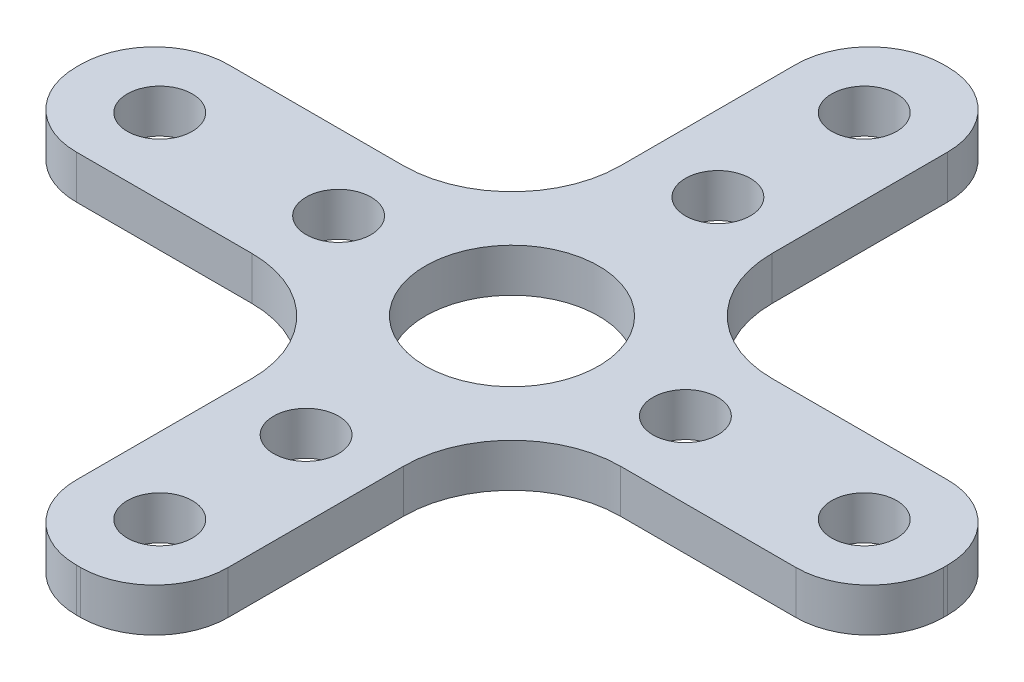
ISO-10303-21;
HEADER;
FILE_DESCRIPTION(('STEP AP214'),'2;1');
FILE_NAME('part.step','',(''),(''),'','','');
FILE_SCHEMA(('AUTOMOTIVE_DESIGN { 1 0 10303 214 1 1 1 1 }'));
ENDSEC;
DATA;
#1=APPLICATION_CONTEXT('core data for automotive mechanical design processes');
#2=APPLICATION_PROTOCOL_DEFINITION('international standard','automotive_design',2000,#1);
#3=PRODUCT_CONTEXT('',#1,'mechanical');
#4=PRODUCT('Part','Part','',(#3));
#5=PRODUCT_RELATED_PRODUCT_CATEGORY('part','',(#4));
#6=PRODUCT_DEFINITION_FORMATION('','',#4);
#7=PRODUCT_DEFINITION_CONTEXT('part definition',#1,'design');
#8=PRODUCT_DEFINITION('design','',#6,#7);
#9=PRODUCT_DEFINITION_SHAPE('','',#8);
#10=(LENGTH_UNIT() NAMED_UNIT(*) SI_UNIT(.MILLI.,.METRE.));
#11=(NAMED_UNIT(*) PLANE_ANGLE_UNIT() SI_UNIT($,.RADIAN.));
#12=(NAMED_UNIT(*) SI_UNIT($,.STERADIAN.) SOLID_ANGLE_UNIT());
#13=UNCERTAINTY_MEASURE_WITH_UNIT(LENGTH_MEASURE(1.E-05),#10,'distance_accuracy_value','');
#14=(GEOMETRIC_REPRESENTATION_CONTEXT(3) GLOBAL_UNCERTAINTY_ASSIGNED_CONTEXT((#13)) GLOBAL_UNIT_ASSIGNED_CONTEXT((#10,
#11,#12)) REPRESENTATION_CONTEXT('',''));
#15=CARTESIAN_POINT('',(0.,0.,0.));
#16=DIRECTION('',(0.,0.,1.));
#17=DIRECTION('',(1.,0.,0.));
#18=AXIS2_PLACEMENT_3D('',#15,#16,#17);
#19=CARTESIAN_POINT('',(-8.5,2.,-8.5));
#20=DIRECTION('',(0.,-1.,0.));
#21=DIRECTION('',(0.,0.,-1.));
#22=AXIS2_PLACEMENT_3D('',#19,#20,#21);
#23=PLANE('',#22);
#24=CARTESIAN_POINT('',(-8.5,2.,-8.5));
#25=DIRECTION('',(0.,-1.,0.));
#26=DIRECTION('',(0.,0.,-1.));
#27=AXIS2_PLACEMENT_3D('',#24,#25,#26);
#28=CIRCLE('',#27,5.);
#29=CARTESIAN_POINT('',(-3.5,2.,-8.50000000000004));
#30=VERTEX_POINT('',#29);
#31=CARTESIAN_POINT('',(-8.50000000000004,2.,-3.5));
#32=VERTEX_POINT('',#31);
#33=EDGE_CURVE('E312',#30,#32,#28,.T.);
#34=ORIENTED_EDGE('',*,*,#33,.T.);
#35=DIRECTION('',(-1.,0.,0.));
#36=VECTOR('',#35,1.);
#37=CARTESIAN_POINT('',(-8.50000000000004,2.,-3.5));
#38=LINE('',#37,#36);
#39=CARTESIAN_POINT('',(-16.6,2.,-3.5));
#40=VERTEX_POINT('',#39);
#41=EDGE_CURVE('E152',#32,#40,#38,.T.);
#42=ORIENTED_EDGE('',*,*,#41,.T.);
#43=CARTESIAN_POINT('',(-16.6,2.,-0.1));
#44=DIRECTION('',(0.,1.,0.));
#45=DIRECTION('',(0.,0.,1.));
#46=AXIS2_PLACEMENT_3D('',#43,#44,#45);
#47=CIRCLE('',#46,3.4);
#48=CARTESIAN_POINT('',(-20.,2.,-0.0999999999999755));
#49=VERTEX_POINT('',#48);
#50=EDGE_CURVE('E397',#40,#49,#47,.T.);
#51=ORIENTED_EDGE('',*,*,#50,.T.);
#52=DIRECTION('',(0.,0.,1.));
#53=VECTOR('',#52,1.);
#54=CARTESIAN_POINT('',(-20.,2.,-0.0999999999999755));
#55=LINE('',#54,#53);
#56=CARTESIAN_POINT('',(-20.,2.,0.0999999999999763));
#57=VERTEX_POINT('',#56);
#58=EDGE_CURVE('E417',#49,#57,#55,.T.);
#59=ORIENTED_EDGE('',*,*,#58,.T.);
#60=CARTESIAN_POINT('',(-16.6,2.,0.100000000000001));
#61=DIRECTION('',(0.,1.,0.));
#62=DIRECTION('',(0.,0.,1.));
#63=AXIS2_PLACEMENT_3D('',#60,#61,#62);
#64=CIRCLE('',#63,3.4);
#65=CARTESIAN_POINT('',(-16.6,2.,3.5));
#66=VERTEX_POINT('',#65);
#67=EDGE_CURVE('E413',#57,#66,#64,.T.);
#68=ORIENTED_EDGE('',*,*,#67,.T.);
#69=DIRECTION('',(1.,0.,0.));
#70=VECTOR('',#69,1.);
#71=CARTESIAN_POINT('',(-16.6,2.,3.5));
#72=LINE('',#71,#70);
#73=CARTESIAN_POINT('',(-8.50000000000004,2.,3.5));
#74=VERTEX_POINT('',#73);
#75=EDGE_CURVE('E416',#66,#74,#72,.T.);
#76=ORIENTED_EDGE('',*,*,#75,.T.);
#77=CARTESIAN_POINT('',(-8.5,2.,8.5));
#78=DIRECTION('',(0.,-1.,0.));
#79=DIRECTION('',(0.,0.,-1.));
#80=AXIS2_PLACEMENT_3D('',#77,#78,#79);
#81=CIRCLE('',#80,5.);
#82=CARTESIAN_POINT('',(-3.5,2.,8.50000000000004));
#83=VERTEX_POINT('',#82);
#84=EDGE_CURVE('E421',#74,#83,#81,.T.);
#85=ORIENTED_EDGE('',*,*,#84,.T.);
#86=DIRECTION('',(0.,0.,1.));
#87=VECTOR('',#86,1.);
#88=CARTESIAN_POINT('',(-3.5,2.,8.50000000000004));
#89=LINE('',#88,#87);
#90=CARTESIAN_POINT('',(-3.5,2.,16.6));
#91=VERTEX_POINT('',#90);
#92=EDGE_CURVE('E428',#83,#91,#89,.T.);
#93=ORIENTED_EDGE('',*,*,#92,.T.);
#94=CARTESIAN_POINT('',(-0.100000000000004,2.,16.6));
#95=DIRECTION('',(0.,1.,0.));
#96=DIRECTION('',(0.,0.,1.));
#97=AXIS2_PLACEMENT_3D('',#94,#95,#96);
#98=CIRCLE('',#97,3.4);
#99=CARTESIAN_POINT('',(-0.099999999999979,2.,20.));
#100=VERTEX_POINT('',#99);
#101=EDGE_CURVE('E431',#91,#100,#98,.T.);
#102=ORIENTED_EDGE('',*,*,#101,.T.);
#103=DIRECTION('',(1.,0.,0.));
#104=VECTOR('',#103,1.);
#105=CARTESIAN_POINT('',(-0.099999999999979,2.,20.));
#106=LINE('',#105,#104);
#107=CARTESIAN_POINT('',(0.0999999999999735,2.,20.));
#108=VERTEX_POINT('',#107);
#109=EDGE_CURVE('E434',#100,#108,#106,.T.);
#110=ORIENTED_EDGE('',*,*,#109,.T.);
#111=CARTESIAN_POINT('',(0.0999999999999977,2.,16.6));
#112=DIRECTION('',(0.,1.,0.));
#113=DIRECTION('',(0.,0.,1.));
#114=AXIS2_PLACEMENT_3D('',#111,#112,#113);
#115=CIRCLE('',#114,3.4);
#116=CARTESIAN_POINT('',(3.5,2.,16.6));
#117=VERTEX_POINT('',#116);
#118=EDGE_CURVE('E437',#108,#117,#115,.T.);
#119=ORIENTED_EDGE('',*,*,#118,.T.);
#120=DIRECTION('',(0.,0.,-1.));
#121=VECTOR('',#120,1.);
#122=CARTESIAN_POINT('',(3.5,2.,16.6));
#123=LINE('',#122,#121);
#124=CARTESIAN_POINT('',(3.5,2.,8.50000000000004));
#125=VERTEX_POINT('',#124);
#126=EDGE_CURVE('E440',#117,#125,#123,.T.);
#127=ORIENTED_EDGE('',*,*,#126,.T.);
#128=CARTESIAN_POINT('',(8.49999999999999,2.,8.5));
#129=DIRECTION('',(0.,-1.,0.));
#130=DIRECTION('',(0.,0.,1.));
#131=AXIS2_PLACEMENT_3D('',#128,#129,#130);
#132=CIRCLE('',#131,5.);
#133=CARTESIAN_POINT('',(8.50000000000003,2.,3.5));
#134=VERTEX_POINT('',#133);
#135=EDGE_CURVE('E443',#125,#134,#132,.T.);
#136=ORIENTED_EDGE('',*,*,#135,.T.);
#137=DIRECTION('',(1.,0.,0.));
#138=VECTOR('',#137,1.);
#139=CARTESIAN_POINT('',(8.50000000000003,2.,3.5));
#140=LINE('',#139,#138);
#141=CARTESIAN_POINT('',(16.6,2.,3.5));
#142=VERTEX_POINT('',#141);
#143=EDGE_CURVE('E446',#134,#142,#140,.T.);
#144=ORIENTED_EDGE('',*,*,#143,.T.);
#145=CARTESIAN_POINT('',(16.6,2.,0.100000000000001));
#146=DIRECTION('',(0.,1.,0.));
#147=DIRECTION('',(0.,0.,1.));
#148=AXIS2_PLACEMENT_3D('',#145,#146,#147);
#149=CIRCLE('',#148,3.4);
#150=CARTESIAN_POINT('',(20.,2.,0.0999999999999764));
#151=VERTEX_POINT('',#150);
#152=EDGE_CURVE('E449',#142,#151,#149,.T.);
#153=ORIENTED_EDGE('',*,*,#152,.T.);
#154=DIRECTION('',(0.,0.,-1.));
#155=VECTOR('',#154,1.);
#156=CARTESIAN_POINT('',(20.,2.,0.0999999999999764));
#157=LINE('',#156,#155);
#158=CARTESIAN_POINT('',(20.,2.,-0.0999999999999763));
#159=VERTEX_POINT('',#158);
#160=EDGE_CURVE('E452',#151,#159,#157,.T.);
#161=ORIENTED_EDGE('',*,*,#160,.T.);
#162=CARTESIAN_POINT('',(16.6,2.,-0.1));
#163=DIRECTION('',(0.,1.,0.));
#164=DIRECTION('',(0.,0.,-1.));
#165=AXIS2_PLACEMENT_3D('',#162,#163,#164);
#166=CIRCLE('',#165,3.4);
#167=CARTESIAN_POINT('',(16.6,2.,-3.5));
#168=VERTEX_POINT('',#167);
#169=EDGE_CURVE('E455',#159,#168,#166,.T.);
#170=ORIENTED_EDGE('',*,*,#169,.T.);
#171=DIRECTION('',(-1.,0.,0.));
#172=VECTOR('',#171,1.);
#173=CARTESIAN_POINT('',(16.6,2.,-3.5));
#174=LINE('',#173,#172);
#175=CARTESIAN_POINT('',(8.50000000000003,2.,-3.5));
#176=VERTEX_POINT('',#175);
#177=EDGE_CURVE('E458',#168,#176,#174,.T.);
#178=ORIENTED_EDGE('',*,*,#177,.T.);
#179=CARTESIAN_POINT('',(8.49999999999999,2.,-8.5));
#180=DIRECTION('',(0.,-1.,0.));
#181=DIRECTION('',(0.,0.,-1.));
#182=AXIS2_PLACEMENT_3D('',#179,#180,#181);
#183=CIRCLE('',#182,5.);
#184=CARTESIAN_POINT('',(3.5,2.,-8.50000000000004));
#185=VERTEX_POINT('',#184);
#186=EDGE_CURVE('E461',#176,#185,#183,.T.);
#187=ORIENTED_EDGE('',*,*,#186,.T.);
#188=DIRECTION('',(0.,0.,-1.));
#189=VECTOR('',#188,1.);
#190=CARTESIAN_POINT('',(3.5,2.,-8.50000000000004));
#191=LINE('',#190,#189);
#192=CARTESIAN_POINT('',(3.5,2.,-16.6));
#193=VERTEX_POINT('',#192);
#194=EDGE_CURVE('E464',#185,#193,#191,.T.);
#195=ORIENTED_EDGE('',*,*,#194,.T.);
#196=CARTESIAN_POINT('',(0.0999999999999977,2.,-16.6));
#197=DIRECTION('',(0.,1.,0.));
#198=DIRECTION('',(0.,0.,1.));
#199=AXIS2_PLACEMENT_3D('',#196,#197,#198);
#200=CIRCLE('',#199,3.4);
#201=CARTESIAN_POINT('',(0.0999999999999729,2.,-20.));
#202=VERTEX_POINT('',#201);
#203=EDGE_CURVE('E219',#193,#202,#200,.T.);
#204=ORIENTED_EDGE('',*,*,#203,.T.);
#205=DIRECTION('',(-1.,0.,0.));
#206=VECTOR('',#205,1.);
#207=CARTESIAN_POINT('',(0.0999999999999729,2.,-20.));
#208=LINE('',#207,#206);
#209=CARTESIAN_POINT('',(-0.0999999999999792,2.,-20.));
#210=VERTEX_POINT('',#209);
#211=EDGE_CURVE('E213',#202,#210,#208,.T.);
#212=ORIENTED_EDGE('',*,*,#211,.T.);
#213=CARTESIAN_POINT('',(-0.100000000000004,2.,-16.6));
#214=DIRECTION('',(0.,1.,0.));
#215=DIRECTION('',(0.,0.,1.));
#216=AXIS2_PLACEMENT_3D('',#213,#214,#215);
#217=CIRCLE('',#216,3.4);
#218=CARTESIAN_POINT('',(-3.5,2.,-16.6));
#219=VERTEX_POINT('',#218);
#220=EDGE_CURVE('E217',#210,#219,#217,.T.);
#221=ORIENTED_EDGE('',*,*,#220,.T.);
#222=DIRECTION('',(0.,0.,1.));
#223=VECTOR('',#222,1.);
#224=CARTESIAN_POINT('',(-3.5,2.,-16.6));
#225=LINE('',#224,#223);
#226=EDGE_CURVE('E61',#219,#30,#225,.T.);
#227=ORIENTED_EDGE('',*,*,#226,.T.);
#228=EDGE_LOOP('',(#34,#42,#51,#59,#68,#76,#85,#93,#102,#110,#119,#127,#136,#144,#153,#161,#170,
#178,#187,#195,#204,#212,#221,#227));
#229=FACE_BOUND('',#228,.T.);
#230=CARTESIAN_POINT('',(0.,2.,0.));
#231=DIRECTION('',(0.,1.,0.));
#232=DIRECTION('',(0.,0.,1.));
#233=AXIS2_PLACEMENT_3D('',#230,#231,#232);
#234=CIRCLE('',#233,4.);
#235=CARTESIAN_POINT('',(0.,2.,4.));
#236=VERTEX_POINT('',#235);
#237=EDGE_CURVE('E246',#236,#236,#234,.T.);
#238=ORIENTED_EDGE('',*,*,#237,.F.);
#239=EDGE_LOOP('',(#238));
#240=FACE_BOUND('',#239,.T.);
#241=CARTESIAN_POINT('',(0.,2.,-9.5));
#242=DIRECTION('',(0.,1.,0.));
#243=DIRECTION('',(0.,0.,1.));
#244=AXIS2_PLACEMENT_3D('',#241,#242,#243);
#245=CIRCLE('',#244,1.5);
#246=CARTESIAN_POINT('',(0.,2.,-8.));
#247=VERTEX_POINT('',#246);
#248=EDGE_CURVE('E594',#247,#247,#245,.T.);
#249=ORIENTED_EDGE('',*,*,#248,.F.);
#250=EDGE_LOOP('',(#249));
#251=FACE_BOUND('',#250,.T.);
#252=CARTESIAN_POINT('',(0.,2.,-16.25));
#253=DIRECTION('',(0.,1.,0.));
#254=DIRECTION('',(0.,0.,1.));
#255=AXIS2_PLACEMENT_3D('',#252,#253,#254);
#256=CIRCLE('',#255,1.5);
#257=CARTESIAN_POINT('',(0.,2.,-14.75));
#258=VERTEX_POINT('',#257);
#259=EDGE_CURVE('E586',#258,#258,#256,.T.);
#260=ORIENTED_EDGE('',*,*,#259,.F.);
#261=EDGE_LOOP('',(#260));
#262=FACE_BOUND('',#261,.T.);
#263=CARTESIAN_POINT('',(0.,2.,9.5));
#264=DIRECTION('',(0.,1.,0.));
#265=DIRECTION('',(0.,0.,-1.));
#266=AXIS2_PLACEMENT_3D('',#263,#264,#265);
#267=CIRCLE('',#266,1.5);
#268=CARTESIAN_POINT('',(0.,2.,8.));
#269=VERTEX_POINT('',#268);
#270=EDGE_CURVE('E578',#269,#269,#267,.T.);
#271=ORIENTED_EDGE('',*,*,#270,.F.);
#272=EDGE_LOOP('',(#271));
#273=FACE_BOUND('',#272,.T.);
#274=CARTESIAN_POINT('',(0.,2.,16.25));
#275=DIRECTION('',(0.,1.,0.));
#276=DIRECTION('',(0.,0.,-1.));
#277=AXIS2_PLACEMENT_3D('',#274,#275,#276);
#278=CIRCLE('',#277,1.5);
#279=CARTESIAN_POINT('',(0.,2.,14.75));
#280=VERTEX_POINT('',#279);
#281=EDGE_CURVE('E570',#280,#280,#278,.T.);
#282=ORIENTED_EDGE('',*,*,#281,.F.);
#283=EDGE_LOOP('',(#282));
#284=FACE_BOUND('',#283,.T.);
#285=CARTESIAN_POINT('',(8.,2.,0.));
#286=DIRECTION('',(0.,1.,0.));
#287=DIRECTION('',(0.,0.,1.));
#288=AXIS2_PLACEMENT_3D('',#285,#286,#287);
#289=CIRCLE('',#288,1.5);
#290=CARTESIAN_POINT('',(8.,2.,1.5));
#291=VERTEX_POINT('',#290);
#292=EDGE_CURVE('E562',#291,#291,#289,.T.);
#293=ORIENTED_EDGE('',*,*,#292,.F.);
#294=EDGE_LOOP('',(#293));
#295=FACE_BOUND('',#294,.T.);
#296=CARTESIAN_POINT('',(16.25,2.,0.));
#297=DIRECTION('',(0.,1.,0.));
#298=DIRECTION('',(0.,0.,1.));
#299=AXIS2_PLACEMENT_3D('',#296,#297,#298);
#300=CIRCLE('',#299,1.5);
#301=CARTESIAN_POINT('',(16.25,2.,1.5));
#302=VERTEX_POINT('',#301);
#303=EDGE_CURVE('E554',#302,#302,#300,.T.);
#304=ORIENTED_EDGE('',*,*,#303,.F.);
#305=EDGE_LOOP('',(#304));
#306=FACE_BOUND('',#305,.T.);
#307=CARTESIAN_POINT('',(-16.25,2.,0.));
#308=DIRECTION('',(0.,1.,0.));
#309=DIRECTION('',(0.,0.,-1.));
#310=AXIS2_PLACEMENT_3D('',#307,#308,#309);
#311=CIRCLE('',#310,1.5);
#312=CARTESIAN_POINT('',(-16.25,2.,-1.5));
#313=VERTEX_POINT('',#312);
#314=EDGE_CURVE('E546',#313,#313,#311,.T.);
#315=ORIENTED_EDGE('',*,*,#314,.F.);
#316=EDGE_LOOP('',(#315));
#317=FACE_BOUND('',#316,.T.);
#318=CARTESIAN_POINT('',(-7.99999999999999,2.,0.));
#319=DIRECTION('',(0.,1.,0.));
#320=DIRECTION('',(0.,0.,-1.));
#321=AXIS2_PLACEMENT_3D('',#318,#319,#320);
#322=CIRCLE('',#321,1.5);
#323=CARTESIAN_POINT('',(-7.99999999999999,2.,-1.5));
#324=VERTEX_POINT('',#323);
#325=EDGE_CURVE('E535',#324,#324,#322,.T.);
#326=ORIENTED_EDGE('',*,*,#325,.F.);
#327=EDGE_LOOP('',(#326));
#328=FACE_BOUND('',#327,.T.);
#329=ADVANCED_FACE('F43',(#229,#240,#251,#262,#273,#284,#295,#306,#317,#328),#23,.F.);
#330=CARTESIAN_POINT('',(-8.5,0.,-8.5));
#331=DIRECTION('',(0.,-1.,0.));
#332=DIRECTION('',(0.,0.,-1.));
#333=AXIS2_PLACEMENT_3D('',#330,#331,#332);
#334=PLANE('',#333);
#335=CARTESIAN_POINT('',(-16.25,0.,0.));
#336=DIRECTION('',(0.,1.,0.));
#337=DIRECTION('',(0.,0.,-1.));
#338=AXIS2_PLACEMENT_3D('',#335,#336,#337);
#339=CIRCLE('',#338,1.5);
#340=CARTESIAN_POINT('',(-16.25,0.,-1.5));
#341=VERTEX_POINT('',#340);
#342=EDGE_CURVE('E543',#341,#341,#339,.T.);
#343=ORIENTED_EDGE('',*,*,#342,.T.);
#344=EDGE_LOOP('',(#343));
#345=FACE_BOUND('',#344,.T.);
#346=CARTESIAN_POINT('',(8.,0.,0.));
#347=DIRECTION('',(0.,1.,0.));
#348=DIRECTION('',(0.,0.,1.));
#349=AXIS2_PLACEMENT_3D('',#346,#347,#348);
#350=CIRCLE('',#349,1.5);
#351=CARTESIAN_POINT('',(8.,0.,1.5));
#352=VERTEX_POINT('',#351);
#353=EDGE_CURVE('E558',#352,#352,#350,.T.);
#354=ORIENTED_EDGE('',*,*,#353,.T.);
#355=EDGE_LOOP('',(#354));
#356=FACE_BOUND('',#355,.T.);
#357=CARTESIAN_POINT('',(0.,0.,9.5));
#358=DIRECTION('',(0.,1.,0.));
#359=DIRECTION('',(0.,0.,-1.));
#360=AXIS2_PLACEMENT_3D('',#357,#358,#359);
#361=CIRCLE('',#360,1.5);
#362=CARTESIAN_POINT('',(0.,0.,8.));
#363=VERTEX_POINT('',#362);
#364=EDGE_CURVE('E574',#363,#363,#361,.T.);
#365=ORIENTED_EDGE('',*,*,#364,.T.);
#366=EDGE_LOOP('',(#365));
#367=FACE_BOUND('',#366,.T.);
#368=CARTESIAN_POINT('',(0.,0.,-9.5));
#369=DIRECTION('',(0.,1.,0.));
#370=DIRECTION('',(0.,0.,1.));
#371=AXIS2_PLACEMENT_3D('',#368,#369,#370);
#372=CIRCLE('',#371,1.5);
#373=CARTESIAN_POINT('',(0.,0.,-8.));
#374=VERTEX_POINT('',#373);
#375=EDGE_CURVE('E590',#374,#374,#372,.T.);
#376=ORIENTED_EDGE('',*,*,#375,.T.);
#377=EDGE_LOOP('',(#376));
#378=FACE_BOUND('',#377,.T.);
#379=CARTESIAN_POINT('',(-8.5,0.,-8.5));
#380=DIRECTION('',(0.,-1.,0.));
#381=DIRECTION('',(0.,0.,-1.));
#382=AXIS2_PLACEMENT_3D('',#379,#380,#381);
#383=CIRCLE('',#382,5.);
#384=CARTESIAN_POINT('',(-3.5,0.,-8.50000000000004));
#385=VERTEX_POINT('',#384);
#386=CARTESIAN_POINT('',(-8.50000000000004,0.,-3.5));
#387=VERTEX_POINT('',#386);
#388=EDGE_CURVE('E241',#385,#387,#383,.T.);
#389=ORIENTED_EDGE('',*,*,#388,.F.);
#390=DIRECTION('',(0.,0.,1.));
#391=VECTOR('',#390,1.);
#392=CARTESIAN_POINT('',(-3.5,0.,-16.6));
#393=LINE('',#392,#391);
#394=CARTESIAN_POINT('',(-3.5,0.,-16.6));
#395=VERTEX_POINT('',#394);
#396=EDGE_CURVE('E144',#395,#385,#393,.T.);
#397=ORIENTED_EDGE('',*,*,#396,.F.);
#398=CARTESIAN_POINT('',(-0.100000000000004,0.,-16.6));
#399=DIRECTION('',(0.,1.,0.));
#400=DIRECTION('',(0.,0.,1.));
#401=AXIS2_PLACEMENT_3D('',#398,#399,#400);
#402=CIRCLE('',#401,3.4);
#403=CARTESIAN_POINT('',(-0.0999999999999792,0.,-20.));
#404=VERTEX_POINT('',#403);
#405=EDGE_CURVE('E138',#404,#395,#402,.T.);
#406=ORIENTED_EDGE('',*,*,#405,.F.);
#407=DIRECTION('',(-1.,0.,0.));
#408=VECTOR('',#407,1.);
#409=CARTESIAN_POINT('',(0.0999999999999729,0.,-20.));
#410=LINE('',#409,#408);
#411=CARTESIAN_POINT('',(0.0999999999999729,0.,-20.));
#412=VERTEX_POINT('',#411);
#413=EDGE_CURVE('E228',#412,#404,#410,.T.);
#414=ORIENTED_EDGE('',*,*,#413,.F.);
#415=CARTESIAN_POINT('',(0.0999999999999977,0.,-16.6));
#416=DIRECTION('',(0.,1.,0.));
#417=DIRECTION('',(0.,0.,1.));
#418=AXIS2_PLACEMENT_3D('',#415,#416,#417);
#419=CIRCLE('',#418,3.4);
#420=CARTESIAN_POINT('',(3.5,0.,-16.6));
#421=VERTEX_POINT('',#420);
#422=EDGE_CURVE('E303',#421,#412,#419,.T.);
#423=ORIENTED_EDGE('',*,*,#422,.F.);
#424=DIRECTION('',(0.,0.,-1.));
#425=VECTOR('',#424,1.);
#426=CARTESIAN_POINT('',(3.5,0.,-8.50000000000004));
#427=LINE('',#426,#425);
#428=CARTESIAN_POINT('',(3.5,0.,-8.50000000000004));
#429=VERTEX_POINT('',#428);
#430=EDGE_CURVE('E300',#429,#421,#427,.T.);
#431=ORIENTED_EDGE('',*,*,#430,.F.);
#432=CARTESIAN_POINT('',(8.49999999999999,0.,-8.5));
#433=DIRECTION('',(0.,-1.,0.));
#434=DIRECTION('',(0.,0.,-1.));
#435=AXIS2_PLACEMENT_3D('',#432,#433,#434);
#436=CIRCLE('',#435,5.);
#437=CARTESIAN_POINT('',(8.50000000000003,0.,-3.5));
#438=VERTEX_POINT('',#437);
#439=EDGE_CURVE('E297',#438,#429,#436,.T.);
#440=ORIENTED_EDGE('',*,*,#439,.F.);
#441=DIRECTION('',(-1.,0.,0.));
#442=VECTOR('',#441,1.);
#443=CARTESIAN_POINT('',(16.6,0.,-3.5));
#444=LINE('',#443,#442);
#445=CARTESIAN_POINT('',(16.6,0.,-3.5));
#446=VERTEX_POINT('',#445);
#447=EDGE_CURVE('E294',#446,#438,#444,.T.);
#448=ORIENTED_EDGE('',*,*,#447,.F.);
#449=CARTESIAN_POINT('',(16.6,0.,-0.1));
#450=DIRECTION('',(0.,1.,0.));
#451=DIRECTION('',(0.,0.,-1.));
#452=AXIS2_PLACEMENT_3D('',#449,#450,#451);
#453=CIRCLE('',#452,3.4);
#454=CARTESIAN_POINT('',(20.,0.,-0.0999999999999763));
#455=VERTEX_POINT('',#454);
#456=EDGE_CURVE('E291',#455,#446,#453,.T.);
#457=ORIENTED_EDGE('',*,*,#456,.F.);
#458=DIRECTION('',(0.,0.,-1.));
#459=VECTOR('',#458,1.);
#460=CARTESIAN_POINT('',(20.,0.,0.0999999999999764));
#461=LINE('',#460,#459);
#462=CARTESIAN_POINT('',(20.,0.,0.0999999999999764));
#463=VERTEX_POINT('',#462);
#464=EDGE_CURVE('E288',#463,#455,#461,.T.);
#465=ORIENTED_EDGE('',*,*,#464,.F.);
#466=CARTESIAN_POINT('',(16.6,0.,0.100000000000001));
#467=DIRECTION('',(0.,1.,0.));
#468=DIRECTION('',(0.,0.,1.));
#469=AXIS2_PLACEMENT_3D('',#466,#467,#468);
#470=CIRCLE('',#469,3.4);
#471=CARTESIAN_POINT('',(16.6,0.,3.5));
#472=VERTEX_POINT('',#471);
#473=EDGE_CURVE('E285',#472,#463,#470,.T.);
#474=ORIENTED_EDGE('',*,*,#473,.F.);
#475=DIRECTION('',(1.,0.,0.));
#476=VECTOR('',#475,1.);
#477=CARTESIAN_POINT('',(8.50000000000003,0.,3.5));
#478=LINE('',#477,#476);
#479=CARTESIAN_POINT('',(8.50000000000003,0.,3.5));
#480=VERTEX_POINT('',#479);
#481=EDGE_CURVE('E282',#480,#472,#478,.T.);
#482=ORIENTED_EDGE('',*,*,#481,.F.);
#483=CARTESIAN_POINT('',(8.49999999999999,0.,8.5));
#484=DIRECTION('',(0.,-1.,0.));
#485=DIRECTION('',(0.,0.,1.));
#486=AXIS2_PLACEMENT_3D('',#483,#484,#485);
#487=CIRCLE('',#486,5.);
#488=CARTESIAN_POINT('',(3.5,0.,8.50000000000004));
#489=VERTEX_POINT('',#488);
#490=EDGE_CURVE('E279',#489,#480,#487,.T.);
#491=ORIENTED_EDGE('',*,*,#490,.F.);
#492=DIRECTION('',(0.,0.,-1.));
#493=VECTOR('',#492,1.);
#494=CARTESIAN_POINT('',(3.5,0.,16.6));
#495=LINE('',#494,#493);
#496=CARTESIAN_POINT('',(3.5,0.,16.6));
#497=VERTEX_POINT('',#496);
#498=EDGE_CURVE('E276',#497,#489,#495,.T.);
#499=ORIENTED_EDGE('',*,*,#498,.F.);
#500=CARTESIAN_POINT('',(0.0999999999999977,0.,16.6));
#501=DIRECTION('',(0.,1.,0.));
#502=DIRECTION('',(0.,0.,1.));
#503=AXIS2_PLACEMENT_3D('',#500,#501,#502);
#504=CIRCLE('',#503,3.4);
#505=CARTESIAN_POINT('',(0.0999999999999735,0.,20.));
#506=VERTEX_POINT('',#505);
#507=EDGE_CURVE('E273',#506,#497,#504,.T.);
#508=ORIENTED_EDGE('',*,*,#507,.F.);
#509=DIRECTION('',(1.,0.,0.));
#510=VECTOR('',#509,1.);
#511=CARTESIAN_POINT('',(-0.099999999999979,0.,20.));
#512=LINE('',#511,#510);
#513=CARTESIAN_POINT('',(-0.099999999999979,0.,20.));
#514=VERTEX_POINT('',#513);
#515=EDGE_CURVE('E270',#514,#506,#512,.T.);
#516=ORIENTED_EDGE('',*,*,#515,.F.);
#517=CARTESIAN_POINT('',(-0.100000000000004,0.,16.6));
#518=DIRECTION('',(0.,1.,0.));
#519=DIRECTION('',(0.,0.,1.));
#520=AXIS2_PLACEMENT_3D('',#517,#518,#519);
#521=CIRCLE('',#520,3.4);
#522=CARTESIAN_POINT('',(-3.5,0.,16.6));
#523=VERTEX_POINT('',#522);
#524=EDGE_CURVE('E267',#523,#514,#521,.T.);
#525=ORIENTED_EDGE('',*,*,#524,.F.);
#526=DIRECTION('',(0.,0.,1.));
#527=VECTOR('',#526,1.);
#528=CARTESIAN_POINT('',(-3.5,0.,8.50000000000004));
#529=LINE('',#528,#527);
#530=CARTESIAN_POINT('',(-3.5,0.,8.50000000000004));
#531=VERTEX_POINT('',#530);
#532=EDGE_CURVE('E264',#531,#523,#529,.T.);
#533=ORIENTED_EDGE('',*,*,#532,.F.);
#534=CARTESIAN_POINT('',(-8.5,0.,8.5));
#535=DIRECTION('',(0.,-1.,0.));
#536=DIRECTION('',(0.,0.,-1.));
#537=AXIS2_PLACEMENT_3D('',#534,#535,#536);
#538=CIRCLE('',#537,5.);
#539=CARTESIAN_POINT('',(-8.50000000000004,0.,3.5));
#540=VERTEX_POINT('',#539);
#541=EDGE_CURVE('E261',#540,#531,#538,.T.);
#542=ORIENTED_EDGE('',*,*,#541,.F.);
#543=DIRECTION('',(1.,0.,0.));
#544=VECTOR('',#543,1.);
#545=CARTESIAN_POINT('',(-16.6,0.,3.5));
#546=LINE('',#545,#544);
#547=CARTESIAN_POINT('',(-16.6,0.,3.5));
#548=VERTEX_POINT('',#547);
#549=EDGE_CURVE('E258',#548,#540,#546,.T.);
#550=ORIENTED_EDGE('',*,*,#549,.F.);
#551=CARTESIAN_POINT('',(-16.6,0.,0.100000000000001));
#552=DIRECTION('',(0.,1.,0.));
#553=DIRECTION('',(0.,0.,1.));
#554=AXIS2_PLACEMENT_3D('',#551,#552,#553);
#555=CIRCLE('',#554,3.4);
#556=CARTESIAN_POINT('',(-20.,0.,0.0999999999999763));
#557=VERTEX_POINT('',#556);
#558=EDGE_CURVE('E255',#557,#548,#555,.T.);
#559=ORIENTED_EDGE('',*,*,#558,.F.);
#560=DIRECTION('',(0.,0.,1.));
#561=VECTOR('',#560,1.);
#562=CARTESIAN_POINT('',(-20.,0.,-0.0999999999999755));
#563=LINE('',#562,#561);
#564=CARTESIAN_POINT('',(-20.,0.,-0.0999999999999755));
#565=VERTEX_POINT('',#564);
#566=EDGE_CURVE('E252',#565,#557,#563,.T.);
#567=ORIENTED_EDGE('',*,*,#566,.F.);
#568=CARTESIAN_POINT('',(-16.6,0.,-0.1));
#569=DIRECTION('',(0.,1.,0.));
#570=DIRECTION('',(0.,0.,1.));
#571=AXIS2_PLACEMENT_3D('',#568,#569,#570);
#572=CIRCLE('',#571,3.4);
#573=CARTESIAN_POINT('',(-16.6,0.,-3.5));
#574=VERTEX_POINT('',#573);
#575=EDGE_CURVE('E249',#574,#565,#572,.T.);
#576=ORIENTED_EDGE('',*,*,#575,.F.);
#577=DIRECTION('',(-1.,0.,0.));
#578=VECTOR('',#577,1.);
#579=CARTESIAN_POINT('',(-8.50000000000004,0.,-3.5));
#580=LINE('',#579,#578);
#581=EDGE_CURVE('E245',#387,#574,#580,.T.);
#582=ORIENTED_EDGE('',*,*,#581,.F.);
#583=EDGE_LOOP('',(#389,#397,#406,#414,#423,#431,#440,#448,#457,#465,#474,#482,#491,#499,#508,
#516,#525,#533,#542,#550,#559,#567,#576,#582));
#584=FACE_BOUND('',#583,.T.);
#585=CARTESIAN_POINT('',(0.,0.,0.));
#586=DIRECTION('',(0.,1.,0.));
#587=DIRECTION('',(0.,0.,1.));
#588=AXIS2_PLACEMENT_3D('',#585,#586,#587);
#589=CIRCLE('',#588,4.);
#590=CARTESIAN_POINT('',(0.,0.,4.));
#591=VERTEX_POINT('',#590);
#592=EDGE_CURVE('E598',#591,#591,#589,.T.);
#593=ORIENTED_EDGE('',*,*,#592,.T.);
#594=EDGE_LOOP('',(#593));
#595=FACE_BOUND('',#594,.T.);
#596=CARTESIAN_POINT('',(0.,0.,-16.25));
#597=DIRECTION('',(0.,1.,0.));
#598=DIRECTION('',(0.,0.,1.));
#599=AXIS2_PLACEMENT_3D('',#596,#597,#598);
#600=CIRCLE('',#599,1.5);
#601=CARTESIAN_POINT('',(0.,0.,-14.75));
#602=VERTEX_POINT('',#601);
#603=EDGE_CURVE('E582',#602,#602,#600,.T.);
#604=ORIENTED_EDGE('',*,*,#603,.T.);
#605=EDGE_LOOP('',(#604));
#606=FACE_BOUND('',#605,.T.);
#607=CARTESIAN_POINT('',(0.,0.,16.25));
#608=DIRECTION('',(0.,1.,0.));
#609=DIRECTION('',(0.,0.,-1.));
#610=AXIS2_PLACEMENT_3D('',#607,#608,#609);
#611=CIRCLE('',#610,1.5);
#612=CARTESIAN_POINT('',(0.,0.,14.75));
#613=VERTEX_POINT('',#612);
#614=EDGE_CURVE('E566',#613,#613,#611,.T.);
#615=ORIENTED_EDGE('',*,*,#614,.T.);
#616=EDGE_LOOP('',(#615));
#617=FACE_BOUND('',#616,.T.);
#618=CARTESIAN_POINT('',(16.25,0.,0.));
#619=DIRECTION('',(0.,1.,0.));
#620=DIRECTION('',(0.,0.,1.));
#621=AXIS2_PLACEMENT_3D('',#618,#619,#620);
#622=CIRCLE('',#621,1.5);
#623=CARTESIAN_POINT('',(16.25,0.,1.5));
#624=VERTEX_POINT('',#623);
#625=EDGE_CURVE('E550',#624,#624,#622,.T.);
#626=ORIENTED_EDGE('',*,*,#625,.T.);
#627=EDGE_LOOP('',(#626));
#628=FACE_BOUND('',#627,.T.);
#629=CARTESIAN_POINT('',(-7.99999999999999,0.,0.));
#630=DIRECTION('',(0.,1.,0.));
#631=DIRECTION('',(0.,0.,-1.));
#632=AXIS2_PLACEMENT_3D('',#629,#630,#631);
#633=CIRCLE('',#632,1.5);
#634=CARTESIAN_POINT('',(-7.99999999999999,0.,-1.5));
#635=VERTEX_POINT('',#634);
#636=EDGE_CURVE('E538',#635,#635,#633,.T.);
#637=ORIENTED_EDGE('',*,*,#636,.T.);
#638=EDGE_LOOP('',(#637));
#639=FACE_BOUND('',#638,.T.);
#640=ADVANCED_FACE('F401',(#345,#356,#367,#378,#584,#595,#606,#617,#628,#639),#334,.T.);
#641=CARTESIAN_POINT('',(-8.5,2.,-8.5));
#642=DIRECTION('',(0.,-1.,0.));
#643=DIRECTION('',(0.,0.,-1.));
#644=AXIS2_PLACEMENT_3D('',#641,#642,#643);
#645=CYLINDRICAL_SURFACE('',#644,5.);
#646=ORIENTED_EDGE('',*,*,#388,.T.);
#647=DIRECTION('',(0.,-1.,0.));
#648=VECTOR('',#647,1.);
#649=CARTESIAN_POINT('',(-8.50000000000004,2.,-3.5));
#650=LINE('',#649,#648);
#651=EDGE_CURVE('E11',#32,#387,#650,.T.);
#652=ORIENTED_EDGE('',*,*,#651,.F.);
#653=ORIENTED_EDGE('',*,*,#33,.F.);
#654=DIRECTION('',(0.,-1.,0.));
#655=VECTOR('',#654,1.);
#656=CARTESIAN_POINT('',(-3.5,2.,-8.50000000000004));
#657=LINE('',#656,#655);
#658=EDGE_CURVE('E237',#30,#385,#657,.T.);
#659=ORIENTED_EDGE('',*,*,#658,.T.);
#660=EDGE_LOOP('',(#646,#652,#653,#659));
#661=FACE_BOUND('',#660,.T.);
#662=ADVANCED_FACE('F45',(#661),#645,.F.);
#663=CARTESIAN_POINT('',(-8.50000000000004,2.,-3.5));
#664=DIRECTION('',(0.,0.,1.));
#665=DIRECTION('',(1.,0.,0.));
#666=AXIS2_PLACEMENT_3D('',#663,#664,#665);
#667=PLANE('',#666);
#668=ORIENTED_EDGE('',*,*,#581,.T.);
#669=DIRECTION('',(0.,-1.,0.));
#670=VECTOR('',#669,1.);
#671=CARTESIAN_POINT('',(-16.6,2.,-3.5));
#672=LINE('',#671,#670);
#673=EDGE_CURVE('E53',#40,#574,#672,.T.);
#674=ORIENTED_EDGE('',*,*,#673,.F.);
#675=ORIENTED_EDGE('',*,*,#41,.F.);
#676=ORIENTED_EDGE('',*,*,#651,.T.);
#677=EDGE_LOOP('',(#668,#674,#675,#676));
#678=FACE_BOUND('',#677,.T.);
#679=ADVANCED_FACE('F881',(#678),#667,.F.);
#680=CARTESIAN_POINT('',(-16.6,2.,-0.1));
#681=DIRECTION('',(0.,-1.,0.));
#682=DIRECTION('',(0.,0.,-1.));
#683=AXIS2_PLACEMENT_3D('',#680,#681,#682);
#684=CYLINDRICAL_SURFACE('',#683,3.4);
#685=ORIENTED_EDGE('',*,*,#575,.T.);
#686=DIRECTION('',(0.,-1.,0.));
#687=VECTOR('',#686,1.);
#688=CARTESIAN_POINT('',(-20.,2.,-0.0999999999999755));
#689=LINE('',#688,#687);
#690=EDGE_CURVE('E387',#49,#565,#689,.T.);
#691=ORIENTED_EDGE('',*,*,#690,.F.);
#692=ORIENTED_EDGE('',*,*,#50,.F.);
#693=ORIENTED_EDGE('',*,*,#673,.T.);
#694=EDGE_LOOP('',(#685,#691,#692,#693));
#695=FACE_BOUND('',#694,.T.);
#696=ADVANCED_FACE('F395',(#695),#684,.T.);
#697=CARTESIAN_POINT('',(-20.,2.,-0.0999999999999755));
#698=DIRECTION('',(1.,0.,0.));
#699=DIRECTION('',(0.,0.,-1.));
#700=AXIS2_PLACEMENT_3D('',#697,#698,#699);
#701=PLANE('',#700);
#702=ORIENTED_EDGE('',*,*,#566,.T.);
#703=DIRECTION('',(0.,-1.,0.));
#704=VECTOR('',#703,1.);
#705=CARTESIAN_POINT('',(-20.,2.,0.0999999999999763));
#706=LINE('',#705,#704);
#707=EDGE_CURVE('E383',#57,#557,#706,.T.);
#708=ORIENTED_EDGE('',*,*,#707,.F.);
#709=ORIENTED_EDGE('',*,*,#58,.F.);
#710=ORIENTED_EDGE('',*,*,#690,.T.);
#711=EDGE_LOOP('',(#702,#708,#709,#710));
#712=FACE_BOUND('',#711,.T.);
#713=ADVANCED_FACE('F407',(#712),#701,.F.);
#714=CARTESIAN_POINT('',(-16.6,2.,0.100000000000001));
#715=DIRECTION('',(0.,-1.,0.));
#716=DIRECTION('',(0.,0.,-1.));
#717=AXIS2_PLACEMENT_3D('',#714,#715,#716);
#718=CYLINDRICAL_SURFACE('',#717,3.4);
#719=ORIENTED_EDGE('',*,*,#558,.T.);
#720=DIRECTION('',(0.,-1.,0.));
#721=VECTOR('',#720,1.);
#722=CARTESIAN_POINT('',(-16.6,2.,3.5));
#723=LINE('',#722,#721);
#724=EDGE_CURVE('E379',#66,#548,#723,.T.);
#725=ORIENTED_EDGE('',*,*,#724,.F.);
#726=ORIENTED_EDGE('',*,*,#67,.F.);
#727=ORIENTED_EDGE('',*,*,#707,.T.);
#728=EDGE_LOOP('',(#719,#725,#726,#727));
#729=FACE_BOUND('',#728,.T.);
#730=ADVANCED_FACE('F411',(#729),#718,.T.);
#731=CARTESIAN_POINT('',(-16.6,2.,3.5));
#732=DIRECTION('',(0.,0.,-1.));
#733=DIRECTION('',(-1.,0.,0.));
#734=AXIS2_PLACEMENT_3D('',#731,#732,#733);
#735=PLANE('',#734);
#736=ORIENTED_EDGE('',*,*,#549,.T.);
#737=DIRECTION('',(0.,-1.,0.));
#738=VECTOR('',#737,1.);
#739=CARTESIAN_POINT('',(-8.50000000000004,2.,3.5));
#740=LINE('',#739,#738);
#741=EDGE_CURVE('E375',#74,#540,#740,.T.);
#742=ORIENTED_EDGE('',*,*,#741,.F.);
#743=ORIENTED_EDGE('',*,*,#75,.F.);
#744=ORIENTED_EDGE('',*,*,#724,.T.);
#745=EDGE_LOOP('',(#736,#742,#743,#744));
#746=FACE_BOUND('',#745,.T.);
#747=ADVANCED_FACE('F846',(#746),#735,.F.);
#748=CARTESIAN_POINT('',(-8.5,2.,8.5));
#749=DIRECTION('',(0.,-1.,0.));
#750=DIRECTION('',(0.,0.,-1.));
#751=AXIS2_PLACEMENT_3D('',#748,#749,#750);
#752=CYLINDRICAL_SURFACE('',#751,5.);
#753=ORIENTED_EDGE('',*,*,#541,.T.);
#754=DIRECTION('',(0.,-1.,0.));
#755=VECTOR('',#754,1.);
#756=CARTESIAN_POINT('',(-3.5,2.,8.50000000000004));
#757=LINE('',#756,#755);
#758=EDGE_CURVE('E371',#83,#531,#757,.T.);
#759=ORIENTED_EDGE('',*,*,#758,.F.);
#760=ORIENTED_EDGE('',*,*,#84,.F.);
#761=ORIENTED_EDGE('',*,*,#741,.T.);
#762=EDGE_LOOP('',(#753,#759,#760,#761));
#763=FACE_BOUND('',#762,.T.);
#764=ADVANCED_FACE('F836',(#763),#752,.F.);
#765=CARTESIAN_POINT('',(-3.5,2.,8.50000000000004));
#766=DIRECTION('',(1.,0.,0.));
#767=DIRECTION('',(0.,0.,-1.));
#768=AXIS2_PLACEMENT_3D('',#765,#766,#767);
#769=PLANE('',#768);
#770=ORIENTED_EDGE('',*,*,#532,.T.);
#771=DIRECTION('',(0.,-1.,0.));
#772=VECTOR('',#771,1.);
#773=CARTESIAN_POINT('',(-3.5,2.,16.6));
#774=LINE('',#773,#772);
#775=EDGE_CURVE('E367',#91,#523,#774,.T.);
#776=ORIENTED_EDGE('',*,*,#775,.F.);
#777=ORIENTED_EDGE('',*,*,#92,.F.);
#778=ORIENTED_EDGE('',*,*,#758,.T.);
#779=EDGE_LOOP('',(#770,#776,#777,#778));
#780=FACE_BOUND('',#779,.T.);
#781=ADVANCED_FACE('F826',(#780),#769,.F.);
#782=CARTESIAN_POINT('',(-0.100000000000004,2.,16.6));
#783=DIRECTION('',(0.,-1.,0.));
#784=DIRECTION('',(0.,0.,-1.));
#785=AXIS2_PLACEMENT_3D('',#782,#783,#784);
#786=CYLINDRICAL_SURFACE('',#785,3.4);
#787=ORIENTED_EDGE('',*,*,#524,.T.);
#788=DIRECTION('',(0.,-1.,0.));
#789=VECTOR('',#788,1.);
#790=CARTESIAN_POINT('',(-0.099999999999979,2.,20.));
#791=LINE('',#790,#789);
#792=EDGE_CURVE('E363',#100,#514,#791,.T.);
#793=ORIENTED_EDGE('',*,*,#792,.F.);
#794=ORIENTED_EDGE('',*,*,#101,.F.);
#795=ORIENTED_EDGE('',*,*,#775,.T.);
#796=EDGE_LOOP('',(#787,#793,#794,#795));
#797=FACE_BOUND('',#796,.T.);
#798=ADVANCED_FACE('F816',(#797),#786,.T.);
#799=CARTESIAN_POINT('',(-0.099999999999979,2.,20.));
#800=DIRECTION('',(0.,0.,-1.));
#801=DIRECTION('',(-1.,0.,0.));
#802=AXIS2_PLACEMENT_3D('',#799,#800,#801);
#803=PLANE('',#802);
#804=ORIENTED_EDGE('',*,*,#515,.T.);
#805=DIRECTION('',(0.,-1.,0.));
#806=VECTOR('',#805,1.);
#807=CARTESIAN_POINT('',(0.0999999999999735,2.,20.));
#808=LINE('',#807,#806);
#809=EDGE_CURVE('E359',#108,#506,#808,.T.);
#810=ORIENTED_EDGE('',*,*,#809,.F.);
#811=ORIENTED_EDGE('',*,*,#109,.F.);
#812=ORIENTED_EDGE('',*,*,#792,.T.);
#813=EDGE_LOOP('',(#804,#810,#811,#812));
#814=FACE_BOUND('',#813,.T.);
#815=ADVANCED_FACE('F806',(#814),#803,.F.);
#816=CARTESIAN_POINT('',(0.0999999999999977,2.,16.6));
#817=DIRECTION('',(0.,-1.,0.));
#818=DIRECTION('',(0.,0.,-1.));
#819=AXIS2_PLACEMENT_3D('',#816,#817,#818);
#820=CYLINDRICAL_SURFACE('',#819,3.4);
#821=ORIENTED_EDGE('',*,*,#507,.T.);
#822=DIRECTION('',(0.,-1.,0.));
#823=VECTOR('',#822,1.);
#824=CARTESIAN_POINT('',(3.5,2.,16.6));
#825=LINE('',#824,#823);
#826=EDGE_CURVE('E355',#117,#497,#825,.T.);
#827=ORIENTED_EDGE('',*,*,#826,.F.);
#828=ORIENTED_EDGE('',*,*,#118,.F.);
#829=ORIENTED_EDGE('',*,*,#809,.T.);
#830=EDGE_LOOP('',(#821,#827,#828,#829));
#831=FACE_BOUND('',#830,.T.);
#832=ADVANCED_FACE('F796',(#831),#820,.T.);
#833=CARTESIAN_POINT('',(3.5,2.,16.6));
#834=DIRECTION('',(-1.,0.,0.));
#835=DIRECTION('',(0.,0.,1.));
#836=AXIS2_PLACEMENT_3D('',#833,#834,#835);
#837=PLANE('',#836);
#838=ORIENTED_EDGE('',*,*,#498,.T.);
#839=DIRECTION('',(0.,-1.,0.));
#840=VECTOR('',#839,1.);
#841=CARTESIAN_POINT('',(3.5,2.,8.50000000000004));
#842=LINE('',#841,#840);
#843=EDGE_CURVE('E351',#125,#489,#842,.T.);
#844=ORIENTED_EDGE('',*,*,#843,.F.);
#845=ORIENTED_EDGE('',*,*,#126,.F.);
#846=ORIENTED_EDGE('',*,*,#826,.T.);
#847=EDGE_LOOP('',(#838,#844,#845,#846));
#848=FACE_BOUND('',#847,.T.);
#849=ADVANCED_FACE('F786',(#848),#837,.F.);
#850=CARTESIAN_POINT('',(8.49999999999999,2.,8.5));
#851=DIRECTION('',(0.,-1.,0.));
#852=DIRECTION('',(0.,0.,-1.));
#853=AXIS2_PLACEMENT_3D('',#850,#851,#852);
#854=CYLINDRICAL_SURFACE('',#853,5.);
#855=ORIENTED_EDGE('',*,*,#490,.T.);
#856=DIRECTION('',(0.,-1.,0.));
#857=VECTOR('',#856,1.);
#858=CARTESIAN_POINT('',(8.50000000000003,2.,3.5));
#859=LINE('',#858,#857);
#860=EDGE_CURVE('E347',#134,#480,#859,.T.);
#861=ORIENTED_EDGE('',*,*,#860,.F.);
#862=ORIENTED_EDGE('',*,*,#135,.F.);
#863=ORIENTED_EDGE('',*,*,#843,.T.);
#864=EDGE_LOOP('',(#855,#861,#862,#863));
#865=FACE_BOUND('',#864,.T.);
#866=ADVANCED_FACE('F776',(#865),#854,.F.);
#867=CARTESIAN_POINT('',(8.50000000000003,2.,3.5));
#868=DIRECTION('',(0.,0.,-1.));
#869=DIRECTION('',(-1.,0.,0.));
#870=AXIS2_PLACEMENT_3D('',#867,#868,#869);
#871=PLANE('',#870);
#872=ORIENTED_EDGE('',*,*,#481,.T.);
#873=DIRECTION('',(0.,-1.,0.));
#874=VECTOR('',#873,1.);
#875=CARTESIAN_POINT('',(16.6,2.,3.5));
#876=LINE('',#875,#874);
#877=EDGE_CURVE('E343',#142,#472,#876,.T.);
#878=ORIENTED_EDGE('',*,*,#877,.F.);
#879=ORIENTED_EDGE('',*,*,#143,.F.);
#880=ORIENTED_EDGE('',*,*,#860,.T.);
#881=EDGE_LOOP('',(#872,#878,#879,#880));
#882=FACE_BOUND('',#881,.T.);
#883=ADVANCED_FACE('F766',(#882),#871,.F.);
#884=CARTESIAN_POINT('',(16.6,2.,0.100000000000001));
#885=DIRECTION('',(0.,-1.,0.));
#886=DIRECTION('',(0.,0.,-1.));
#887=AXIS2_PLACEMENT_3D('',#884,#885,#886);
#888=CYLINDRICAL_SURFACE('',#887,3.4);
#889=ORIENTED_EDGE('',*,*,#473,.T.);
#890=DIRECTION('',(0.,-1.,0.));
#891=VECTOR('',#890,1.);
#892=CARTESIAN_POINT('',(20.,2.,0.0999999999999764));
#893=LINE('',#892,#891);
#894=EDGE_CURVE('E339',#151,#463,#893,.T.);
#895=ORIENTED_EDGE('',*,*,#894,.F.);
#896=ORIENTED_EDGE('',*,*,#152,.F.);
#897=ORIENTED_EDGE('',*,*,#877,.T.);
#898=EDGE_LOOP('',(#889,#895,#896,#897));
#899=FACE_BOUND('',#898,.T.);
#900=ADVANCED_FACE('F756',(#899),#888,.T.);
#901=CARTESIAN_POINT('',(20.,2.,0.0999999999999764));
#902=DIRECTION('',(-1.,0.,0.));
#903=DIRECTION('',(0.,0.,1.));
#904=AXIS2_PLACEMENT_3D('',#901,#902,#903);
#905=PLANE('',#904);
#906=ORIENTED_EDGE('',*,*,#464,.T.);
#907=DIRECTION('',(0.,-1.,0.));
#908=VECTOR('',#907,1.);
#909=CARTESIAN_POINT('',(20.,2.,-0.0999999999999763));
#910=LINE('',#909,#908);
#911=EDGE_CURVE('E335',#159,#455,#910,.T.);
#912=ORIENTED_EDGE('',*,*,#911,.F.);
#913=ORIENTED_EDGE('',*,*,#160,.F.);
#914=ORIENTED_EDGE('',*,*,#894,.T.);
#915=EDGE_LOOP('',(#906,#912,#913,#914));
#916=FACE_BOUND('',#915,.T.);
#917=ADVANCED_FACE('F746',(#916),#905,.F.);
#918=CARTESIAN_POINT('',(16.6,2.,-0.1));
#919=DIRECTION('',(0.,-1.,0.));
#920=DIRECTION('',(0.,0.,-1.));
#921=AXIS2_PLACEMENT_3D('',#918,#919,#920);
#922=CYLINDRICAL_SURFACE('',#921,3.4);
#923=ORIENTED_EDGE('',*,*,#456,.T.);
#924=DIRECTION('',(0.,-1.,0.));
#925=VECTOR('',#924,1.);
#926=CARTESIAN_POINT('',(16.6,2.,-3.5));
#927=LINE('',#926,#925);
#928=EDGE_CURVE('E331',#168,#446,#927,.T.);
#929=ORIENTED_EDGE('',*,*,#928,.F.);
#930=ORIENTED_EDGE('',*,*,#169,.F.);
#931=ORIENTED_EDGE('',*,*,#911,.T.);
#932=EDGE_LOOP('',(#923,#929,#930,#931));
#933=FACE_BOUND('',#932,.T.);
#934=ADVANCED_FACE('F736',(#933),#922,.T.);
#935=CARTESIAN_POINT('',(16.6,2.,-3.5));
#936=DIRECTION('',(0.,0.,1.));
#937=DIRECTION('',(1.,0.,0.));
#938=AXIS2_PLACEMENT_3D('',#935,#936,#937);
#939=PLANE('',#938);
#940=ORIENTED_EDGE('',*,*,#447,.T.);
#941=DIRECTION('',(0.,-1.,0.));
#942=VECTOR('',#941,1.);
#943=CARTESIAN_POINT('',(8.50000000000003,2.,-3.5));
#944=LINE('',#943,#942);
#945=EDGE_CURVE('E327',#176,#438,#944,.T.);
#946=ORIENTED_EDGE('',*,*,#945,.F.);
#947=ORIENTED_EDGE('',*,*,#177,.F.);
#948=ORIENTED_EDGE('',*,*,#928,.T.);
#949=EDGE_LOOP('',(#940,#946,#947,#948));
#950=FACE_BOUND('',#949,.T.);
#951=ADVANCED_FACE('F726',(#950),#939,.F.);
#952=CARTESIAN_POINT('',(8.49999999999999,2.,-8.5));
#953=DIRECTION('',(0.,-1.,0.));
#954=DIRECTION('',(0.,0.,-1.));
#955=AXIS2_PLACEMENT_3D('',#952,#953,#954);
#956=CYLINDRICAL_SURFACE('',#955,5.);
#957=ORIENTED_EDGE('',*,*,#439,.T.);
#958=DIRECTION('',(0.,-1.,0.));
#959=VECTOR('',#958,1.);
#960=CARTESIAN_POINT('',(3.5,2.,-8.50000000000004));
#961=LINE('',#960,#959);
#962=EDGE_CURVE('E323',#185,#429,#961,.T.);
#963=ORIENTED_EDGE('',*,*,#962,.F.);
#964=ORIENTED_EDGE('',*,*,#186,.F.);
#965=ORIENTED_EDGE('',*,*,#945,.T.);
#966=EDGE_LOOP('',(#957,#963,#964,#965));
#967=FACE_BOUND('',#966,.T.);
#968=ADVANCED_FACE('F717',(#967),#956,.F.);
#969=CARTESIAN_POINT('',(3.5,2.,-8.50000000000004));
#970=DIRECTION('',(-1.,0.,0.));
#971=DIRECTION('',(0.,0.,1.));
#972=AXIS2_PLACEMENT_3D('',#969,#970,#971);
#973=PLANE('',#972);
#974=ORIENTED_EDGE('',*,*,#430,.T.);
#975=DIRECTION('',(0.,-1.,0.));
#976=VECTOR('',#975,1.);
#977=CARTESIAN_POINT('',(3.5,2.,-16.6));
#978=LINE('',#977,#976);
#979=EDGE_CURVE('E319',#193,#421,#978,.T.);
#980=ORIENTED_EDGE('',*,*,#979,.F.);
#981=ORIENTED_EDGE('',*,*,#194,.F.);
#982=ORIENTED_EDGE('',*,*,#962,.T.);
#983=EDGE_LOOP('',(#974,#980,#981,#982));
#984=FACE_BOUND('',#983,.T.);
#985=ADVANCED_FACE('F472',(#984),#973,.F.);
#986=CARTESIAN_POINT('',(0.0999999999999977,2.,-16.6));
#987=DIRECTION('',(0.,-1.,0.));
#988=DIRECTION('',(0.,0.,-1.));
#989=AXIS2_PLACEMENT_3D('',#986,#987,#988);
#990=CYLINDRICAL_SURFACE('',#989,3.4);
#991=ORIENTED_EDGE('',*,*,#422,.T.);
#992=DIRECTION('',(0.,-1.,0.));
#993=VECTOR('',#992,1.);
#994=CARTESIAN_POINT('',(0.0999999999999729,2.,-20.));
#995=LINE('',#994,#993);
#996=EDGE_CURVE('E230',#202,#412,#995,.T.);
#997=ORIENTED_EDGE('',*,*,#996,.F.);
#998=ORIENTED_EDGE('',*,*,#203,.F.);
#999=ORIENTED_EDGE('',*,*,#979,.T.);
#1000=EDGE_LOOP('',(#991,#997,#998,#999));
#1001=FACE_BOUND('',#1000,.T.);
#1002=ADVANCED_FACE('F476',(#1001),#990,.T.);
#1003=CARTESIAN_POINT('',(0.0999999999999729,2.,-20.));
#1004=DIRECTION('',(0.,0.,1.));
#1005=DIRECTION('',(1.,0.,0.));
#1006=AXIS2_PLACEMENT_3D('',#1003,#1004,#1005);
#1007=PLANE('',#1006);
#1008=ORIENTED_EDGE('',*,*,#413,.T.);
#1009=DIRECTION('',(0.,-1.,0.));
#1010=VECTOR('',#1009,1.);
#1011=CARTESIAN_POINT('',(-0.0999999999999792,2.,-20.));
#1012=LINE('',#1011,#1010);
#1013=EDGE_CURVE('E225',#210,#404,#1012,.T.);
#1014=ORIENTED_EDGE('',*,*,#1013,.F.);
#1015=ORIENTED_EDGE('',*,*,#211,.F.);
#1016=ORIENTED_EDGE('',*,*,#996,.T.);
#1017=EDGE_LOOP('',(#1008,#1014,#1015,#1016));
#1018=FACE_BOUND('',#1017,.T.);
#1019=ADVANCED_FACE('F226',(#1018),#1007,.F.);
#1020=CARTESIAN_POINT('',(-0.100000000000004,2.,-16.6));
#1021=DIRECTION('',(0.,-1.,0.));
#1022=DIRECTION('',(0.,0.,-1.));
#1023=AXIS2_PLACEMENT_3D('',#1020,#1021,#1022);
#1024=CYLINDRICAL_SURFACE('',#1023,3.4);
#1025=ORIENTED_EDGE('',*,*,#405,.T.);
#1026=DIRECTION('',(0.,-1.,0.));
#1027=VECTOR('',#1026,1.);
#1028=CARTESIAN_POINT('',(-3.5,2.,-16.6));
#1029=LINE('',#1028,#1027);
#1030=EDGE_CURVE('E231',#219,#395,#1029,.T.);
#1031=ORIENTED_EDGE('',*,*,#1030,.F.);
#1032=ORIENTED_EDGE('',*,*,#220,.F.);
#1033=ORIENTED_EDGE('',*,*,#1013,.T.);
#1034=EDGE_LOOP('',(#1025,#1031,#1032,#1033));
#1035=FACE_BOUND('',#1034,.T.);
#1036=ADVANCED_FACE('F233',(#1035),#1024,.T.);
#1037=CARTESIAN_POINT('',(-3.5,2.,-16.6));
#1038=DIRECTION('',(1.,0.,0.));
#1039=DIRECTION('',(0.,0.,-1.));
#1040=AXIS2_PLACEMENT_3D('',#1037,#1038,#1039);
#1041=PLANE('',#1040);
#1042=ORIENTED_EDGE('',*,*,#396,.T.);
#1043=ORIENTED_EDGE('',*,*,#658,.F.);
#1044=ORIENTED_EDGE('',*,*,#226,.F.);
#1045=ORIENTED_EDGE('',*,*,#1030,.T.);
#1046=EDGE_LOOP('',(#1042,#1043,#1044,#1045));
#1047=FACE_BOUND('',#1046,.T.);
#1048=ADVANCED_FACE('F480',(#1047),#1041,.F.);
#1049=CARTESIAN_POINT('',(0.,2.,0.));
#1050=DIRECTION('',(0.,-1.,0.));
#1051=DIRECTION('',(0.,0.,-1.));
#1052=AXIS2_PLACEMENT_3D('',#1049,#1050,#1051);
#1053=CYLINDRICAL_SURFACE('',#1052,4.);
#1054=ORIENTED_EDGE('',*,*,#237,.T.);
#1055=EDGE_LOOP('',(#1054));
#1056=FACE_BOUND('',#1055,.T.);
#1057=ORIENTED_EDGE('',*,*,#592,.F.);
#1058=EDGE_LOOP('',(#1057));
#1059=FACE_BOUND('',#1058,.T.);
#1060=ADVANCED_FACE('F482',(#1056,#1059),#1053,.F.);
#1061=CARTESIAN_POINT('',(0.,2.,-9.5));
#1062=DIRECTION('',(0.,-1.,0.));
#1063=DIRECTION('',(0.,0.,-1.));
#1064=AXIS2_PLACEMENT_3D('',#1061,#1062,#1063);
#1065=CYLINDRICAL_SURFACE('',#1064,1.5);
#1066=ORIENTED_EDGE('',*,*,#248,.T.);
#1067=EDGE_LOOP('',(#1066));
#1068=FACE_BOUND('',#1067,.T.);
#1069=ORIENTED_EDGE('',*,*,#375,.F.);
#1070=EDGE_LOOP('',(#1069));
#1071=FACE_BOUND('',#1070,.T.);
#1072=ADVANCED_FACE('F488',(#1068,#1071),#1065,.F.);
#1073=CARTESIAN_POINT('',(0.,2.,-16.25));
#1074=DIRECTION('',(0.,-1.,0.));
#1075=DIRECTION('',(0.,0.,-1.));
#1076=AXIS2_PLACEMENT_3D('',#1073,#1074,#1075);
#1077=CYLINDRICAL_SURFACE('',#1076,1.5);
#1078=ORIENTED_EDGE('',*,*,#259,.T.);
#1079=EDGE_LOOP('',(#1078));
#1080=FACE_BOUND('',#1079,.T.);
#1081=ORIENTED_EDGE('',*,*,#603,.F.);
#1082=EDGE_LOOP('',(#1081));
#1083=FACE_BOUND('',#1082,.T.);
#1084=ADVANCED_FACE('F502',(#1080,#1083),#1077,.F.);
#1085=CARTESIAN_POINT('',(0.,2.,9.5));
#1086=DIRECTION('',(0.,-1.,0.));
#1087=DIRECTION('',(0.,0.,-1.));
#1088=AXIS2_PLACEMENT_3D('',#1085,#1086,#1087);
#1089=CYLINDRICAL_SURFACE('',#1088,1.5);
#1090=ORIENTED_EDGE('',*,*,#270,.T.);
#1091=EDGE_LOOP('',(#1090));
#1092=FACE_BOUND('',#1091,.T.);
#1093=ORIENTED_EDGE('',*,*,#364,.F.);
#1094=EDGE_LOOP('',(#1093));
#1095=FACE_BOUND('',#1094,.T.);
#1096=ADVANCED_FACE('F506',(#1092,#1095),#1089,.F.);
#1097=CARTESIAN_POINT('',(0.,2.,16.25));
#1098=DIRECTION('',(0.,-1.,0.));
#1099=DIRECTION('',(0.,0.,-1.));
#1100=AXIS2_PLACEMENT_3D('',#1097,#1098,#1099);
#1101=CYLINDRICAL_SURFACE('',#1100,1.5);
#1102=ORIENTED_EDGE('',*,*,#281,.T.);
#1103=EDGE_LOOP('',(#1102));
#1104=FACE_BOUND('',#1103,.T.);
#1105=ORIENTED_EDGE('',*,*,#614,.F.);
#1106=EDGE_LOOP('',(#1105));
#1107=FACE_BOUND('',#1106,.T.);
#1108=ADVANCED_FACE('F510',(#1104,#1107),#1101,.F.);
#1109=CARTESIAN_POINT('',(8.,2.,0.));
#1110=DIRECTION('',(0.,-1.,0.));
#1111=DIRECTION('',(0.,0.,-1.));
#1112=AXIS2_PLACEMENT_3D('',#1109,#1110,#1111);
#1113=CYLINDRICAL_SURFACE('',#1112,1.5);
#1114=ORIENTED_EDGE('',*,*,#292,.T.);
#1115=EDGE_LOOP('',(#1114));
#1116=FACE_BOUND('',#1115,.T.);
#1117=ORIENTED_EDGE('',*,*,#353,.F.);
#1118=EDGE_LOOP('',(#1117));
#1119=FACE_BOUND('',#1118,.T.);
#1120=ADVANCED_FACE('F514',(#1116,#1119),#1113,.F.);
#1121=CARTESIAN_POINT('',(16.25,2.,0.));
#1122=DIRECTION('',(0.,-1.,0.));
#1123=DIRECTION('',(0.,0.,-1.));
#1124=AXIS2_PLACEMENT_3D('',#1121,#1122,#1123);
#1125=CYLINDRICAL_SURFACE('',#1124,1.5);
#1126=ORIENTED_EDGE('',*,*,#303,.T.);
#1127=EDGE_LOOP('',(#1126));
#1128=FACE_BOUND('',#1127,.T.);
#1129=ORIENTED_EDGE('',*,*,#625,.F.);
#1130=EDGE_LOOP('',(#1129));
#1131=FACE_BOUND('',#1130,.T.);
#1132=ADVANCED_FACE('F518',(#1128,#1131),#1125,.F.);
#1133=CARTESIAN_POINT('',(-16.25,2.,0.));
#1134=DIRECTION('',(0.,-1.,0.));
#1135=DIRECTION('',(0.,0.,-1.));
#1136=AXIS2_PLACEMENT_3D('',#1133,#1134,#1135);
#1137=CYLINDRICAL_SURFACE('',#1136,1.5);
#1138=ORIENTED_EDGE('',*,*,#314,.T.);
#1139=EDGE_LOOP('',(#1138));
#1140=FACE_BOUND('',#1139,.T.);
#1141=ORIENTED_EDGE('',*,*,#342,.F.);
#1142=EDGE_LOOP('',(#1141));
#1143=FACE_BOUND('',#1142,.T.);
#1144=ADVANCED_FACE('F522',(#1140,#1143),#1137,.F.);
#1145=CARTESIAN_POINT('',(-7.99999999999999,2.,0.));
#1146=DIRECTION('',(0.,-1.,0.));
#1147=DIRECTION('',(0.,0.,-1.));
#1148=AXIS2_PLACEMENT_3D('',#1145,#1146,#1147);
#1149=CYLINDRICAL_SURFACE('',#1148,1.5);
#1150=ORIENTED_EDGE('',*,*,#325,.T.);
#1151=EDGE_LOOP('',(#1150));
#1152=FACE_BOUND('',#1151,.T.);
#1153=ORIENTED_EDGE('',*,*,#636,.F.);
#1154=EDGE_LOOP('',(#1153));
#1155=FACE_BOUND('',#1154,.T.);
#1156=ADVANCED_FACE('F526',(#1152,#1155),#1149,.F.);
#1157=CLOSED_SHELL('',(#329,#640,#662,#679,#696,#713,#730,#747,#764,#781,#798,#815,#832,#849,
#866,#883,#900,#917,#934,#951,#968,#985,#1002,#1019,#1036,#1048,#1060,#1072,#1084,#1096,#1108,
#1120,#1132,#1144,#1156));
#1158=MANIFOLD_SOLID_BREP('B2',#1157);
#1159=ADVANCED_BREP_SHAPE_REPRESENTATION('',(#18,#1158),#14);
#1160=SHAPE_DEFINITION_REPRESENTATION(#9,#1159);
ENDSEC;
END-ISO-10303-21;
